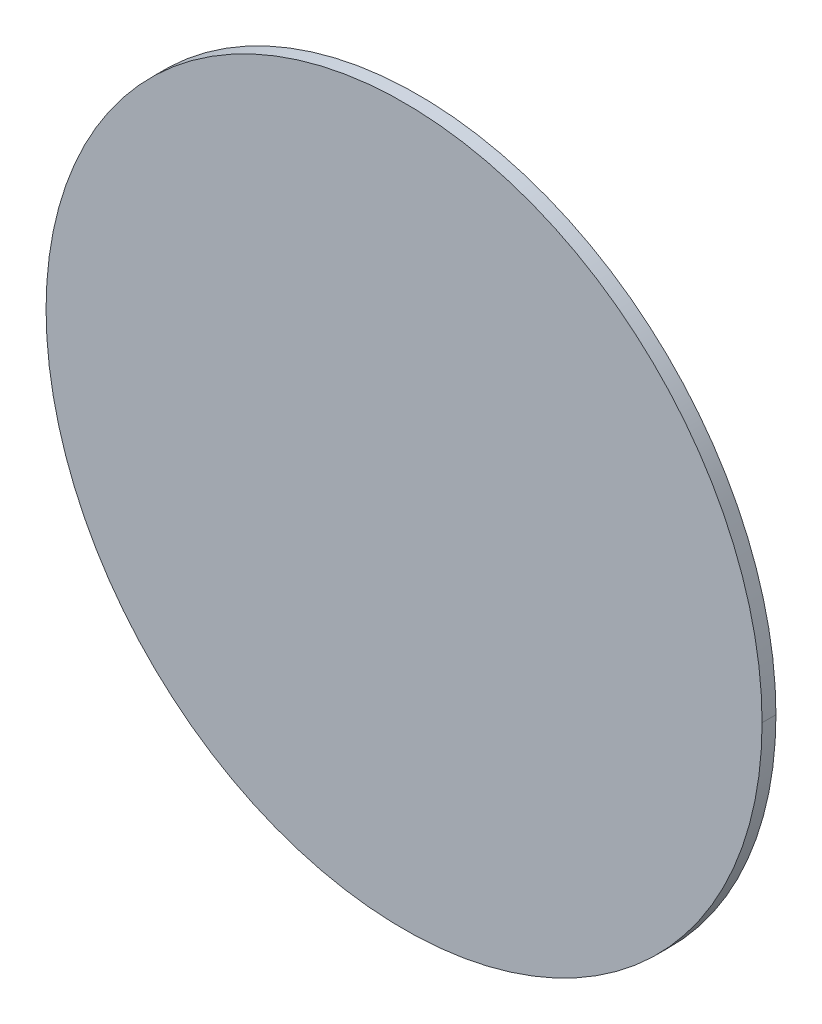
ISO-10303-21;
HEADER;
FILE_DESCRIPTION(('STEP AP214'),'2;1');
FILE_NAME('part.step','',(''),(''),'','','');
FILE_SCHEMA(('AUTOMOTIVE_DESIGN { 1 0 10303 214 1 1 1 1 }'));
ENDSEC;
DATA;
#1=APPLICATION_CONTEXT('core data for automotive mechanical design processes');
#2=APPLICATION_PROTOCOL_DEFINITION('international standard','automotive_design',2000,#1);
#3=PRODUCT_CONTEXT('',#1,'mechanical');
#4=PRODUCT('Part','Part','',(#3));
#5=PRODUCT_RELATED_PRODUCT_CATEGORY('part','',(#4));
#6=PRODUCT_DEFINITION_FORMATION('','',#4);
#7=PRODUCT_DEFINITION_CONTEXT('part definition',#1,'design');
#8=PRODUCT_DEFINITION('design','',#6,#7);
#9=PRODUCT_DEFINITION_SHAPE('','',#8);
#10=(LENGTH_UNIT() NAMED_UNIT(*) SI_UNIT(.MILLI.,.METRE.));
#11=(NAMED_UNIT(*) PLANE_ANGLE_UNIT() SI_UNIT($,.RADIAN.));
#12=(NAMED_UNIT(*) SI_UNIT($,.STERADIAN.) SOLID_ANGLE_UNIT());
#13=UNCERTAINTY_MEASURE_WITH_UNIT(LENGTH_MEASURE(1.E-05),#10,'distance_accuracy_value','');
#14=(GEOMETRIC_REPRESENTATION_CONTEXT(3) GLOBAL_UNCERTAINTY_ASSIGNED_CONTEXT((#13)) GLOBAL_UNIT_ASSIGNED_CONTEXT((#10,
#11,#12)) REPRESENTATION_CONTEXT('',''));
#15=CARTESIAN_POINT('',(0.,0.,0.));
#16=DIRECTION('',(0.,0.,1.));
#17=DIRECTION('',(1.,0.,0.));
#18=AXIS2_PLACEMENT_3D('',#15,#16,#17);
#19=CARTESIAN_POINT('',(-1.24,0.914,0.838));
#20=DIRECTION('',(0.,0.,1.));
#21=DIRECTION('',(1.,0.,0.));
#22=AXIS2_PLACEMENT_3D('',#19,#20,#21);
#23=CYLINDRICAL_SURFACE('',#22,0.0774700000000001);
#24=CARTESIAN_POINT('',(-1.24,0.914,0.838));
#25=DIRECTION('',(0.,0.,-1.));
#26=DIRECTION('',(1.,0.,0.));
#27=AXIS2_PLACEMENT_3D('',#24,#25,#26);
#28=CIRCLE('',#27,0.0774700000000001);
#29=CARTESIAN_POINT('',(-1.31747,0.914,0.838));
#30=VERTEX_POINT('',#29);
#31=CARTESIAN_POINT('',(-1.16253,0.914,0.838));
#32=VERTEX_POINT('',#31);
#33=EDGE_CURVE('E11',#30,#32,#28,.T.);
#34=ORIENTED_EDGE('',*,*,#33,.F.);
#35=DIRECTION('',(0.,0.,1.));
#36=VECTOR('',#35,1.);
#37=CARTESIAN_POINT('',(-1.31747,0.914,0.838));
#38=LINE('',#37,#36);
#39=CARTESIAN_POINT('',(-1.31747,0.914,0.841));
#40=VERTEX_POINT('',#39);
#41=EDGE_CURVE('E24',#30,#40,#38,.T.);
#42=ORIENTED_EDGE('',*,*,#41,.T.);
#43=CARTESIAN_POINT('',(-1.24,0.914,0.841));
#44=DIRECTION('',(0.,0.,1.));
#45=DIRECTION('',(1.,0.,0.));
#46=AXIS2_PLACEMENT_3D('',#43,#44,#45);
#47=CIRCLE('',#46,0.0774700000000001);
#48=CARTESIAN_POINT('',(-1.16253,0.914,0.841));
#49=VERTEX_POINT('',#48);
#50=EDGE_CURVE('E39',#49,#40,#47,.T.);
#51=ORIENTED_EDGE('',*,*,#50,.F.);
#52=DIRECTION('',(0.,0.,1.));
#53=VECTOR('',#52,1.);
#54=CARTESIAN_POINT('',(-1.16253,0.914,0.838));
#55=LINE('',#54,#53);
#56=EDGE_CURVE('E41',#32,#49,#55,.T.);
#57=ORIENTED_EDGE('',*,*,#56,.F.);
#58=EDGE_LOOP('',(#34,#42,#51,#57));
#59=FACE_BOUND('',#58,.T.);
#60=ADVANCED_FACE('F17',(#59),#23,.T.);
#61=CARTESIAN_POINT('',(-1.24,0.914,0.838));
#62=DIRECTION('',(0.,0.,1.));
#63=DIRECTION('',(1.,0.,0.));
#64=AXIS2_PLACEMENT_3D('',#61,#62,#63);
#65=CYLINDRICAL_SURFACE('',#64,0.0774700000000001);
#66=ORIENTED_EDGE('',*,*,#41,.F.);
#67=CARTESIAN_POINT('',(-1.24,0.914,0.838));
#68=DIRECTION('',(0.,0.,-1.));
#69=DIRECTION('',(1.,0.,0.));
#70=AXIS2_PLACEMENT_3D('',#67,#68,#69);
#71=CIRCLE('',#70,0.0774700000000001);
#72=EDGE_CURVE('E50',#32,#30,#71,.T.);
#73=ORIENTED_EDGE('',*,*,#72,.F.);
#74=ORIENTED_EDGE('',*,*,#56,.T.);
#75=CARTESIAN_POINT('',(-1.24,0.914,0.841));
#76=DIRECTION('',(0.,0.,1.));
#77=DIRECTION('',(1.,0.,0.));
#78=AXIS2_PLACEMENT_3D('',#75,#76,#77);
#79=CIRCLE('',#78,0.0774700000000001);
#80=EDGE_CURVE('E49',#40,#49,#79,.T.);
#81=ORIENTED_EDGE('',*,*,#80,.F.);
#82=EDGE_LOOP('',(#66,#73,#74,#81));
#83=FACE_BOUND('',#82,.T.);
#84=ADVANCED_FACE('F48',(#83),#65,.T.);
#85=CARTESIAN_POINT('',(-1.24,0.914,0.838));
#86=DIRECTION('',(0.,0.,1.));
#87=DIRECTION('',(1.,0.,0.));
#88=AXIS2_PLACEMENT_3D('',#85,#86,#87);
#89=PLANE('',#88);
#90=ORIENTED_EDGE('',*,*,#72,.T.);
#91=ORIENTED_EDGE('',*,*,#33,.T.);
#92=EDGE_LOOP('',(#90,#91));
#93=FACE_BOUND('',#92,.T.);
#94=ADVANCED_FACE('F55',(#93),#89,.F.);
#95=CARTESIAN_POINT('',(-1.24,0.914,0.841));
#96=DIRECTION('',(0.,0.,1.));
#97=DIRECTION('',(1.,0.,0.));
#98=AXIS2_PLACEMENT_3D('',#95,#96,#97);
#99=PLANE('',#98);
#100=ORIENTED_EDGE('',*,*,#50,.T.);
#101=ORIENTED_EDGE('',*,*,#80,.T.);
#102=EDGE_LOOP('',(#100,#101));
#103=FACE_BOUND('',#102,.T.);
#104=ADVANCED_FACE('F52',(#103),#99,.T.);
#105=CLOSED_SHELL('',(#60,#84,#94,#104));
#106=MANIFOLD_SOLID_BREP('B1',#105);
#107=ADVANCED_BREP_SHAPE_REPRESENTATION('',(#18,#106),#14);
#108=SHAPE_DEFINITION_REPRESENTATION(#9,#107);
ENDSEC;
END-ISO-10303-21;
